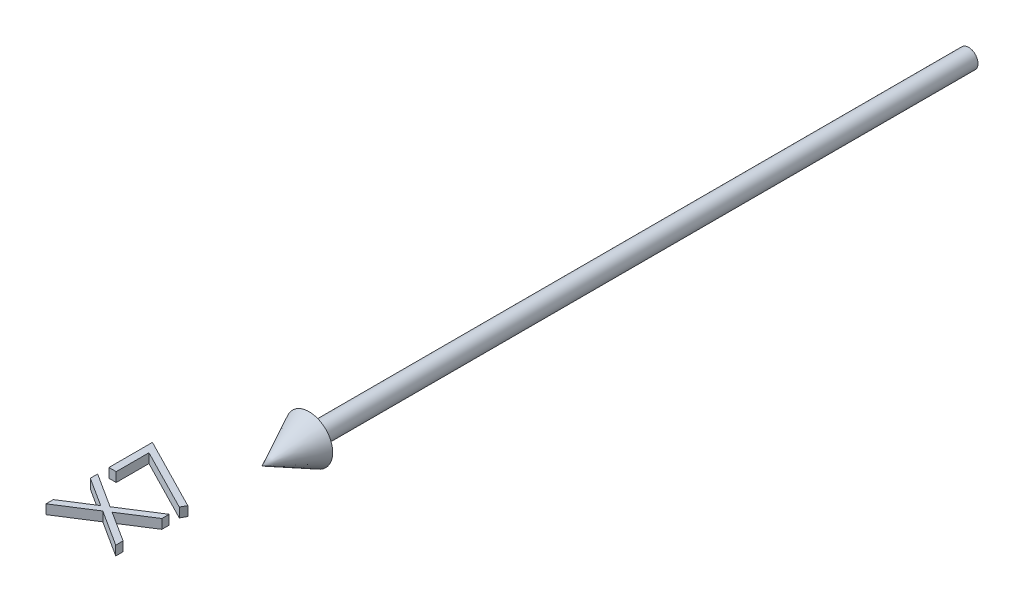
ISO-10303-21;
HEADER;
FILE_DESCRIPTION(('STEP AP214'),'2;1');
FILE_NAME('part.step','',(''),(''),'','','');
FILE_SCHEMA(('AUTOMOTIVE_DESIGN { 1 0 10303 214 1 1 1 1 }'));
ENDSEC;
DATA;
#1=APPLICATION_CONTEXT('core data for automotive mechanical design processes');
#2=APPLICATION_PROTOCOL_DEFINITION('international standard','automotive_design',2000,#1);
#3=PRODUCT_CONTEXT('',#1,'mechanical');
#4=PRODUCT('Part','Part','',(#3));
#5=PRODUCT_RELATED_PRODUCT_CATEGORY('part','',(#4));
#6=PRODUCT_DEFINITION_FORMATION('','',#4);
#7=PRODUCT_DEFINITION_CONTEXT('part definition',#1,'design');
#8=PRODUCT_DEFINITION('design','',#6,#7);
#9=PRODUCT_DEFINITION_SHAPE('','',#8);
#10=(LENGTH_UNIT() NAMED_UNIT(*) SI_UNIT(.MILLI.,.METRE.));
#11=(NAMED_UNIT(*) PLANE_ANGLE_UNIT() SI_UNIT($,.RADIAN.));
#12=(NAMED_UNIT(*) SI_UNIT($,.STERADIAN.) SOLID_ANGLE_UNIT());
#13=UNCERTAINTY_MEASURE_WITH_UNIT(LENGTH_MEASURE(1.E-05),#10,'distance_accuracy_value','');
#14=(GEOMETRIC_REPRESENTATION_CONTEXT(3) GLOBAL_UNCERTAINTY_ASSIGNED_CONTEXT((#13)) GLOBAL_UNIT_ASSIGNED_CONTEXT((#10,
#11,#12)) REPRESENTATION_CONTEXT('',''));
#15=CARTESIAN_POINT('',(0.,0.,0.));
#16=DIRECTION('',(0.,0.,1.));
#17=DIRECTION('',(1.,0.,0.));
#18=AXIS2_PLACEMENT_3D('',#15,#16,#17);
#19=CARTESIAN_POINT('',(-7.65024038461539,1.,176.159855769231));
#20=DIRECTION('',(0.539190475611023,0.,0.842183846324755));
#21=DIRECTION('',(0.842183846324755,0.,-0.539190475611023));
#22=AXIS2_PLACEMENT_3D('',#19,#20,#21);
#23=PLANE('',#22);
#24=DIRECTION('',(0.,-1.,0.));
#25=VECTOR('',#24,1.);
#26=CARTESIAN_POINT('',(-15.,1.,180.865384615385));
#27=LINE('',#26,#25);
#28=CARTESIAN_POINT('',(-15.,1.,180.865384615385));
#29=VERTEX_POINT('',#28);
#30=CARTESIAN_POINT('',(-15.,-1.,180.865384615385));
#31=VERTEX_POINT('',#30);
#32=EDGE_CURVE('E49',#29,#31,#27,.T.);
#33=ORIENTED_EDGE('',*,*,#32,.T.);
#34=DIRECTION('',(-0.842183846324755,0.,0.539190475611023));
#35=VECTOR('',#34,1.);
#36=CARTESIAN_POINT('',(-7.65024038461539,-1.,176.159855769231));
#37=LINE('',#36,#35);
#38=CARTESIAN_POINT('',(-7.65024038461539,-1.,176.159855769231));
#39=VERTEX_POINT('',#38);
#40=EDGE_CURVE('E134',#39,#31,#37,.T.);
#41=ORIENTED_EDGE('',*,*,#40,.F.);
#42=DIRECTION('',(0.,-1.,0.));
#43=VECTOR('',#42,1.);
#44=CARTESIAN_POINT('',(-7.65024038461539,1.,176.159855769231));
#45=LINE('',#44,#43);
#46=CARTESIAN_POINT('',(-7.65024038461539,1.,176.159855769231));
#47=VERTEX_POINT('',#46);
#48=EDGE_CURVE('E12',#47,#39,#45,.T.);
#49=ORIENTED_EDGE('',*,*,#48,.F.);
#50=DIRECTION('',(-0.842183846324755,0.,0.539190475611023));
#51=VECTOR('',#50,1.);
#52=CARTESIAN_POINT('',(-7.65024038461539,1.,176.159855769231));
#53=LINE('',#52,#51);
#54=EDGE_CURVE('E135',#47,#29,#53,.T.);
#55=ORIENTED_EDGE('',*,*,#54,.T.);
#56=EDGE_LOOP('',(#33,#41,#49,#55));
#57=FACE_BOUND('',#56,.T.);
#58=ADVANCED_FACE('F46',(#57),#23,.T.);
#59=CARTESIAN_POINT('',(0.,1.,181.057692307692));
#60=DIRECTION('',(-0.539185104098949,0.,0.842187285298113));
#61=DIRECTION('',(0.842187285298113,0.,0.539185104098949));
#62=AXIS2_PLACEMENT_3D('',#59,#60,#61);
#63=PLANE('',#62);
#64=ORIENTED_EDGE('',*,*,#48,.T.);
#65=DIRECTION('',(-0.842187285298113,0.,-0.539185104098949));
#66=VECTOR('',#65,1.);
#67=CARTESIAN_POINT('',(0.,-1.,181.057692307692));
#68=LINE('',#67,#66);
#69=CARTESIAN_POINT('',(0.,-1.,181.057692307692));
#70=VERTEX_POINT('',#69);
#71=EDGE_CURVE('E152',#70,#39,#68,.T.);
#72=ORIENTED_EDGE('',*,*,#71,.F.);
#73=DIRECTION('',(0.,-1.,0.));
#74=VECTOR('',#73,1.);
#75=CARTESIAN_POINT('',(0.,1.,181.057692307692));
#76=LINE('',#75,#74);
#77=CARTESIAN_POINT('',(0.,1.,181.057692307692));
#78=VERTEX_POINT('',#77);
#79=EDGE_CURVE('E54',#78,#70,#76,.T.);
#80=ORIENTED_EDGE('',*,*,#79,.F.);
#81=DIRECTION('',(-0.842187285298113,0.,-0.539185104098949));
#82=VECTOR('',#81,1.);
#83=CARTESIAN_POINT('',(0.,1.,181.057692307692));
#84=LINE('',#83,#82);
#85=EDGE_CURVE('E140',#78,#47,#84,.T.);
#86=ORIENTED_EDGE('',*,*,#85,.T.);
#87=EDGE_LOOP('',(#64,#72,#80,#86));
#88=FACE_BOUND('',#87,.T.);
#89=ADVANCED_FACE('F264',(#88),#63,.T.);
#90=CARTESIAN_POINT('',(0.,1.,179.504206730769));
#91=DIRECTION('',(1.,0.,0.));
#92=DIRECTION('',(0.,0.,-1.));
#93=AXIS2_PLACEMENT_3D('',#90,#91,#92);
#94=PLANE('',#93);
#95=ORIENTED_EDGE('',*,*,#79,.T.);
#96=DIRECTION('',(0.,0.,1.));
#97=VECTOR('',#96,1.);
#98=CARTESIAN_POINT('',(0.,-1.,179.504206730769));
#99=LINE('',#98,#97);
#100=CARTESIAN_POINT('',(0.,-1.,179.504206730769));
#101=VERTEX_POINT('',#100);
#102=EDGE_CURVE('E177',#101,#70,#99,.T.);
#103=ORIENTED_EDGE('',*,*,#102,.F.);
#104=DIRECTION('',(0.,-1.,0.));
#105=VECTOR('',#104,1.);
#106=CARTESIAN_POINT('',(0.,1.,179.504206730769));
#107=LINE('',#106,#105);
#108=CARTESIAN_POINT('',(0.,1.,179.504206730769));
#109=VERTEX_POINT('',#108);
#110=EDGE_CURVE('E211',#109,#101,#107,.T.);
#111=ORIENTED_EDGE('',*,*,#110,.F.);
#112=DIRECTION('',(0.,0.,1.));
#113=VECTOR('',#112,1.);
#114=CARTESIAN_POINT('',(0.,1.,179.504206730769));
#115=LINE('',#114,#113);
#116=EDGE_CURVE('E207',#109,#78,#115,.T.);
#117=ORIENTED_EDGE('',*,*,#116,.T.);
#118=EDGE_LOOP('',(#95,#103,#111,#117));
#119=FACE_BOUND('',#118,.T.);
#120=ADVANCED_FACE('F262',(#119),#94,.T.);
#121=CARTESIAN_POINT('',(-6.43629807692308,1.,175.384615384615));
#122=DIRECTION('',(0.539087169942496,0.,-0.842249976671648));
#123=DIRECTION('',(-0.842249976671648,0.,-0.539087169942496));
#124=AXIS2_PLACEMENT_3D('',#121,#122,#123);
#125=PLANE('',#124);
#126=ORIENTED_EDGE('',*,*,#110,.T.);
#127=DIRECTION('',(0.842249976671648,0.,0.539087169942496));
#128=VECTOR('',#127,1.);
#129=CARTESIAN_POINT('',(-6.43629807692308,-1.,175.384615384615));
#130=LINE('',#129,#128);
#131=CARTESIAN_POINT('',(-6.43629807692308,-1.,175.384615384615));
#132=VERTEX_POINT('',#131);
#133=EDGE_CURVE('E174',#132,#101,#130,.T.);
#134=ORIENTED_EDGE('',*,*,#133,.F.);
#135=DIRECTION('',(0.,-1.,0.));
#136=VECTOR('',#135,1.);
#137=CARTESIAN_POINT('',(-6.43629807692308,1.,175.384615384615));
#138=LINE('',#137,#136);
#139=CARTESIAN_POINT('',(-6.43629807692308,1.,175.384615384615));
#140=VERTEX_POINT('',#139);
#141=EDGE_CURVE('E213',#140,#132,#138,.T.);
#142=ORIENTED_EDGE('',*,*,#141,.F.);
#143=DIRECTION('',(0.842249976671648,0.,0.539087169942496));
#144=VECTOR('',#143,1.);
#145=CARTESIAN_POINT('',(-6.43629807692308,1.,175.384615384615));
#146=LINE('',#145,#144);
#147=EDGE_CURVE('E204',#140,#109,#146,.T.);
#148=ORIENTED_EDGE('',*,*,#147,.T.);
#149=EDGE_LOOP('',(#126,#134,#142,#148));
#150=FACE_BOUND('',#149,.T.);
#151=ADVANCED_FACE('F260',(#150),#125,.T.);
#152=CARTESIAN_POINT('',(0.,1.,171.265024038462));
#153=DIRECTION('',(0.539087169942498,0.,0.842249976671646));
#154=DIRECTION('',(0.842249976671646,0.,-0.539087169942498));
#155=AXIS2_PLACEMENT_3D('',#152,#153,#154);
#156=PLANE('',#155);
#157=ORIENTED_EDGE('',*,*,#141,.T.);
#158=DIRECTION('',(-0.842249976671646,0.,0.539087169942498));
#159=VECTOR('',#158,1.);
#160=CARTESIAN_POINT('',(0.,-1.,171.265024038462));
#161=LINE('',#160,#159);
#162=CARTESIAN_POINT('',(0.,-1.,171.265024038462));
#163=VERTEX_POINT('',#162);
#164=EDGE_CURVE('E171',#163,#132,#161,.T.);
#165=ORIENTED_EDGE('',*,*,#164,.F.);
#166=DIRECTION('',(0.,-1.,0.));
#167=VECTOR('',#166,1.);
#168=CARTESIAN_POINT('',(0.,1.,171.265024038462));
#169=LINE('',#168,#167);
#170=CARTESIAN_POINT('',(0.,1.,171.265024038462));
#171=VERTEX_POINT('',#170);
#172=EDGE_CURVE('E215',#171,#163,#169,.T.);
#173=ORIENTED_EDGE('',*,*,#172,.F.);
#174=DIRECTION('',(-0.842249976671646,0.,0.539087169942498));
#175=VECTOR('',#174,1.);
#176=CARTESIAN_POINT('',(0.,1.,171.265024038462));
#177=LINE('',#176,#175);
#178=EDGE_CURVE('E201',#171,#140,#177,.T.);
#179=ORIENTED_EDGE('',*,*,#178,.T.);
#180=EDGE_LOOP('',(#157,#165,#173,#179));
#181=FACE_BOUND('',#180,.T.);
#182=ADVANCED_FACE('F255',(#181),#156,.T.);
#183=CARTESIAN_POINT('',(0.,1.,169.711538461538));
#184=DIRECTION('',(1.,0.,0.));
#185=DIRECTION('',(0.,0.,-1.));
#186=AXIS2_PLACEMENT_3D('',#183,#184,#185);
#187=PLANE('',#186);
#188=ORIENTED_EDGE('',*,*,#172,.T.);
#189=DIRECTION('',(0.,0.,1.));
#190=VECTOR('',#189,1.);
#191=CARTESIAN_POINT('',(0.,-1.,169.711538461538));
#192=LINE('',#191,#190);
#193=CARTESIAN_POINT('',(0.,-1.,169.711538461538));
#194=VERTEX_POINT('',#193);
#195=EDGE_CURVE('E168',#194,#163,#192,.T.);
#196=ORIENTED_EDGE('',*,*,#195,.F.);
#197=DIRECTION('',(0.,-1.,0.));
#198=VECTOR('',#197,1.);
#199=CARTESIAN_POINT('',(0.,1.,169.711538461538));
#200=LINE('',#199,#198);
#201=CARTESIAN_POINT('',(0.,1.,169.711538461538));
#202=VERTEX_POINT('',#201);
#203=EDGE_CURVE('E217',#202,#194,#200,.T.);
#204=ORIENTED_EDGE('',*,*,#203,.F.);
#205=DIRECTION('',(0.,0.,1.));
#206=VECTOR('',#205,1.);
#207=CARTESIAN_POINT('',(0.,1.,169.711538461538));
#208=LINE('',#207,#206);
#209=EDGE_CURVE('E198',#202,#171,#208,.T.);
#210=ORIENTED_EDGE('',*,*,#209,.T.);
#211=EDGE_LOOP('',(#188,#196,#204,#210));
#212=FACE_BOUND('',#211,.T.);
#213=ADVANCED_FACE('F250',(#212),#187,.T.);
#214=CARTESIAN_POINT('',(-7.65024038461539,1.,174.606370192308));
#215=DIRECTION('',(-0.538950419912938,0.,-0.842337488703707));
#216=DIRECTION('',(-0.842337488703707,0.,0.538950419912938));
#217=AXIS2_PLACEMENT_3D('',#214,#215,#216);
#218=PLANE('',#217);
#219=ORIENTED_EDGE('',*,*,#203,.T.);
#220=DIRECTION('',(0.842337488703707,0.,-0.538950419912938));
#221=VECTOR('',#220,1.);
#222=CARTESIAN_POINT('',(-7.65024038461539,-1.,174.606370192308));
#223=LINE('',#222,#221);
#224=CARTESIAN_POINT('',(-7.65024038461539,-1.,174.606370192308));
#225=VERTEX_POINT('',#224);
#226=EDGE_CURVE('E165',#225,#194,#223,.T.);
#227=ORIENTED_EDGE('',*,*,#226,.F.);
#228=DIRECTION('',(0.,-1.,0.));
#229=VECTOR('',#228,1.);
#230=CARTESIAN_POINT('',(-7.65024038461539,1.,174.606370192308));
#231=LINE('',#230,#229);
#232=CARTESIAN_POINT('',(-7.65024038461539,1.,174.606370192308));
#233=VERTEX_POINT('',#232);
#234=EDGE_CURVE('E219',#233,#225,#231,.T.);
#235=ORIENTED_EDGE('',*,*,#234,.F.);
#236=DIRECTION('',(0.842337488703707,0.,-0.538950419912938));
#237=VECTOR('',#236,1.);
#238=CARTESIAN_POINT('',(-7.65024038461539,1.,174.606370192308));
#239=LINE('',#238,#237);
#240=EDGE_CURVE('E195',#233,#202,#239,.T.);
#241=ORIENTED_EDGE('',*,*,#240,.T.);
#242=EDGE_LOOP('',(#219,#227,#235,#241));
#243=FACE_BOUND('',#242,.T.);
#244=ADVANCED_FACE('F248',(#243),#218,.T.);
#245=CARTESIAN_POINT('',(-15.,1.,169.903846153846));
#246=DIRECTION('',(0.538946197134425,0.,-0.842340190537257));
#247=DIRECTION('',(-0.842340190537257,0.,-0.538946197134425));
#248=AXIS2_PLACEMENT_3D('',#245,#246,#247);
#249=PLANE('',#248);
#250=ORIENTED_EDGE('',*,*,#234,.T.);
#251=DIRECTION('',(0.842340190537257,0.,0.538946197134425));
#252=VECTOR('',#251,1.);
#253=CARTESIAN_POINT('',(-15.,-1.,169.903846153846));
#254=LINE('',#253,#252);
#255=CARTESIAN_POINT('',(-15.,-1.,169.903846153846));
#256=VERTEX_POINT('',#255);
#257=EDGE_CURVE('E162',#256,#225,#254,.T.);
#258=ORIENTED_EDGE('',*,*,#257,.F.);
#259=DIRECTION('',(0.,-1.,0.));
#260=VECTOR('',#259,1.);
#261=CARTESIAN_POINT('',(-15.,1.,169.903846153846));
#262=LINE('',#261,#260);
#263=CARTESIAN_POINT('',(-15.,1.,169.903846153846));
#264=VERTEX_POINT('',#263);
#265=EDGE_CURVE('E221',#264,#256,#262,.T.);
#266=ORIENTED_EDGE('',*,*,#265,.F.);
#267=DIRECTION('',(0.842340190537257,0.,0.538946197134425));
#268=VECTOR('',#267,1.);
#269=CARTESIAN_POINT('',(-15.,1.,169.903846153846));
#270=LINE('',#269,#268);
#271=EDGE_CURVE('E192',#264,#233,#270,.T.);
#272=ORIENTED_EDGE('',*,*,#271,.T.);
#273=EDGE_LOOP('',(#250,#258,#266,#272));
#274=FACE_BOUND('',#273,.T.);
#275=ADVANCED_FACE('F243',(#274),#249,.T.);
#276=CARTESIAN_POINT('',(-15.,1.,171.457331730769));
#277=DIRECTION('',(-1.,0.,0.));
#278=DIRECTION('',(0.,0.,1.));
#279=AXIS2_PLACEMENT_3D('',#276,#277,#278);
#280=PLANE('',#279);
#281=ORIENTED_EDGE('',*,*,#265,.T.);
#282=DIRECTION('',(0.,0.,-1.));
#283=VECTOR('',#282,1.);
#284=CARTESIAN_POINT('',(-15.,-1.,171.457331730769));
#285=LINE('',#284,#283);
#286=CARTESIAN_POINT('',(-15.,-1.,171.457331730769));
#287=VERTEX_POINT('',#286);
#288=EDGE_CURVE('E159',#287,#256,#285,.T.);
#289=ORIENTED_EDGE('',*,*,#288,.F.);
#290=DIRECTION('',(0.,-1.,0.));
#291=VECTOR('',#290,1.);
#292=CARTESIAN_POINT('',(-15.,1.,171.457331730769));
#293=LINE('',#292,#291);
#294=CARTESIAN_POINT('',(-15.,1.,171.457331730769));
#295=VERTEX_POINT('',#294);
#296=EDGE_CURVE('E223',#295,#287,#293,.T.);
#297=ORIENTED_EDGE('',*,*,#296,.F.);
#298=DIRECTION('',(0.,0.,-1.));
#299=VECTOR('',#298,1.);
#300=CARTESIAN_POINT('',(-15.,1.,171.457331730769));
#301=LINE('',#300,#299);
#302=EDGE_CURVE('E189',#295,#264,#301,.T.);
#303=ORIENTED_EDGE('',*,*,#302,.T.);
#304=EDGE_LOOP('',(#281,#289,#297,#303));
#305=FACE_BOUND('',#304,.T.);
#306=ADVANCED_FACE('F236',(#305),#280,.T.);
#307=CARTESIAN_POINT('',(-8.86418269230769,1.,175.384615384615));
#308=DIRECTION('',(-0.539088809128563,0.,0.842248927498485));
#309=DIRECTION('',(0.842248927498485,0.,0.539088809128563));
#310=AXIS2_PLACEMENT_3D('',#307,#308,#309);
#311=PLANE('',#310);
#312=ORIENTED_EDGE('',*,*,#296,.T.);
#313=DIRECTION('',(-0.842248927498485,0.,-0.539088809128563));
#314=VECTOR('',#313,1.);
#315=CARTESIAN_POINT('',(-8.86418269230769,-1.,175.384615384615));
#316=LINE('',#315,#314);
#317=CARTESIAN_POINT('',(-8.86418269230769,-1.,175.384615384615));
#318=VERTEX_POINT('',#317);
#319=EDGE_CURVE('E156',#318,#287,#316,.T.);
#320=ORIENTED_EDGE('',*,*,#319,.F.);
#321=DIRECTION('',(0.,-1.,0.));
#322=VECTOR('',#321,1.);
#323=CARTESIAN_POINT('',(-8.86418269230769,1.,175.384615384615));
#324=LINE('',#323,#322);
#325=CARTESIAN_POINT('',(-8.86418269230769,1.,175.384615384615));
#326=VERTEX_POINT('',#325);
#327=EDGE_CURVE('E225',#326,#318,#324,.T.);
#328=ORIENTED_EDGE('',*,*,#327,.F.);
#329=DIRECTION('',(-0.842248927498485,0.,-0.539088809128563));
#330=VECTOR('',#329,1.);
#331=CARTESIAN_POINT('',(-8.86418269230769,1.,175.384615384615));
#332=LINE('',#331,#330);
#333=EDGE_CURVE('E186',#326,#295,#332,.T.);
#334=ORIENTED_EDGE('',*,*,#333,.T.);
#335=EDGE_LOOP('',(#312,#320,#328,#334));
#336=FACE_BOUND('',#335,.T.);
#337=ADVANCED_FACE('F233',(#336),#311,.T.);
#338=CARTESIAN_POINT('',(-15.,1.,179.311899038462));
#339=DIRECTION('',(-0.53908880912856,0.,-0.842248927498487));
#340=DIRECTION('',(-0.842248927498487,0.,0.53908880912856));
#341=AXIS2_PLACEMENT_3D('',#338,#339,#340);
#342=PLANE('',#341);
#343=ORIENTED_EDGE('',*,*,#327,.T.);
#344=DIRECTION('',(0.842248927498486,0.,-0.53908880912856));
#345=VECTOR('',#344,1.);
#346=CARTESIAN_POINT('',(-15.,-1.,179.311899038462));
#347=LINE('',#346,#345);
#348=CARTESIAN_POINT('',(-15.,-1.,179.311899038462));
#349=VERTEX_POINT('',#348);
#350=EDGE_CURVE('E147',#349,#318,#347,.T.);
#351=ORIENTED_EDGE('',*,*,#350,.F.);
#352=DIRECTION('',(0.,-1.,0.));
#353=VECTOR('',#352,1.);
#354=CARTESIAN_POINT('',(-15.,1.,179.311899038462));
#355=LINE('',#354,#353);
#356=CARTESIAN_POINT('',(-15.,1.,179.311899038462));
#357=VERTEX_POINT('',#356);
#358=EDGE_CURVE('E139',#357,#349,#355,.T.);
#359=ORIENTED_EDGE('',*,*,#358,.F.);
#360=DIRECTION('',(0.842248927498486,0.,-0.53908880912856));
#361=VECTOR('',#360,1.);
#362=CARTESIAN_POINT('',(-15.,1.,179.311899038462));
#363=LINE('',#362,#361);
#364=EDGE_CURVE('E183',#357,#326,#363,.T.);
#365=ORIENTED_EDGE('',*,*,#364,.T.);
#366=EDGE_LOOP('',(#343,#351,#359,#365));
#367=FACE_BOUND('',#366,.T.);
#368=ADVANCED_FACE('F227',(#367),#342,.T.);
#369=CARTESIAN_POINT('',(-15.,1.,180.865384615385));
#370=DIRECTION('',(-1.,0.,0.));
#371=DIRECTION('',(0.,0.,1.));
#372=AXIS2_PLACEMENT_3D('',#369,#370,#371);
#373=PLANE('',#372);
#374=ORIENTED_EDGE('',*,*,#358,.T.);
#375=DIRECTION('',(0.,0.,-1.));
#376=VECTOR('',#375,1.);
#377=CARTESIAN_POINT('',(-15.,-1.,180.865384615385));
#378=LINE('',#377,#376);
#379=EDGE_CURVE('E142',#31,#349,#378,.T.);
#380=ORIENTED_EDGE('',*,*,#379,.F.);
#381=ORIENTED_EDGE('',*,*,#32,.F.);
#382=DIRECTION('',(0.,0.,-1.));
#383=VECTOR('',#382,1.);
#384=CARTESIAN_POINT('',(-15.,1.,180.865384615385));
#385=LINE('',#384,#383);
#386=EDGE_CURVE('E181',#29,#357,#385,.T.);
#387=ORIENTED_EDGE('',*,*,#386,.T.);
#388=EDGE_LOOP('',(#374,#380,#381,#387));
#389=FACE_BOUND('',#388,.T.);
#390=ADVANCED_FACE('F143',(#389),#373,.T.);
#391=CARTESIAN_POINT('',(0.,1.,0.));
#392=DIRECTION('',(0.,-1.,0.));
#393=DIRECTION('',(0.,0.,-1.));
#394=AXIS2_PLACEMENT_3D('',#391,#392,#393);
#395=PLANE('',#394);
#396=ORIENTED_EDGE('',*,*,#54,.F.);
#397=ORIENTED_EDGE('',*,*,#85,.F.);
#398=ORIENTED_EDGE('',*,*,#116,.F.);
#399=ORIENTED_EDGE('',*,*,#147,.F.);
#400=ORIENTED_EDGE('',*,*,#178,.F.);
#401=ORIENTED_EDGE('',*,*,#209,.F.);
#402=ORIENTED_EDGE('',*,*,#240,.F.);
#403=ORIENTED_EDGE('',*,*,#271,.F.);
#404=ORIENTED_EDGE('',*,*,#302,.F.);
#405=ORIENTED_EDGE('',*,*,#333,.F.);
#406=ORIENTED_EDGE('',*,*,#364,.F.);
#407=ORIENTED_EDGE('',*,*,#386,.F.);
#408=EDGE_LOOP('',(#396,#397,#398,#399,#400,#401,#402,#403,#404,#405,#406,#407));
#409=FACE_BOUND('',#408,.T.);
#410=ADVANCED_FACE('F239',(#409),#395,.F.);
#411=CARTESIAN_POINT('',(0.,-1.,0.));
#412=DIRECTION('',(0.,-1.,0.));
#413=DIRECTION('',(0.,0.,-1.));
#414=AXIS2_PLACEMENT_3D('',#411,#412,#413);
#415=PLANE('',#414);
#416=ORIENTED_EDGE('',*,*,#40,.T.);
#417=ORIENTED_EDGE('',*,*,#379,.T.);
#418=ORIENTED_EDGE('',*,*,#350,.T.);
#419=ORIENTED_EDGE('',*,*,#319,.T.);
#420=ORIENTED_EDGE('',*,*,#288,.T.);
#421=ORIENTED_EDGE('',*,*,#257,.T.);
#422=ORIENTED_EDGE('',*,*,#226,.T.);
#423=ORIENTED_EDGE('',*,*,#195,.T.);
#424=ORIENTED_EDGE('',*,*,#164,.T.);
#425=ORIENTED_EDGE('',*,*,#133,.T.);
#426=ORIENTED_EDGE('',*,*,#102,.T.);
#427=ORIENTED_EDGE('',*,*,#71,.T.);
#428=EDGE_LOOP('',(#416,#417,#418,#419,#420,#421,#422,#423,#424,#425,#426,#427));
#429=FACE_BOUND('',#428,.T.);
#430=ADVANCED_FACE('F150',(#429),#415,.T.);
#431=CLOSED_SHELL('',(#58,#89,#120,#151,#182,#213,#244,#275,#306,#337,#368,#390,#410,#430));
#432=MANIFOLD_SOLID_BREP('B2',#431);
#433=CARTESIAN_POINT('',(-13.4615384615385,1.,167.5));
#434=DIRECTION('',(0.,0.,1.));
#435=DIRECTION('',(1.,0.,0.));
#436=AXIS2_PLACEMENT_3D('',#433,#434,#435);
#437=PLANE('',#436);
#438=DIRECTION('',(0.,-1.,0.));
#439=VECTOR('',#438,1.);
#440=CARTESIAN_POINT('',(-15.,1.,167.5));
#441=LINE('',#440,#439);
#442=CARTESIAN_POINT('',(-15.,1.,167.5));
#443=VERTEX_POINT('',#442);
#444=CARTESIAN_POINT('',(-15.,-1.,167.5));
#445=VERTEX_POINT('',#444);
#446=EDGE_CURVE('E432',#443,#445,#441,.T.);
#447=ORIENTED_EDGE('',*,*,#446,.T.);
#448=DIRECTION('',(-1.,0.,0.));
#449=VECTOR('',#448,1.);
#450=CARTESIAN_POINT('',(-13.4615384615385,-1.,167.5));
#451=LINE('',#450,#449);
#452=CARTESIAN_POINT('',(-13.4615384615385,-1.,167.5));
#453=VERTEX_POINT('',#452);
#454=EDGE_CURVE('E481',#453,#445,#451,.T.);
#455=ORIENTED_EDGE('',*,*,#454,.F.);
#456=DIRECTION('',(0.,-1.,0.));
#457=VECTOR('',#456,1.);
#458=CARTESIAN_POINT('',(-13.4615384615385,1.,167.5));
#459=LINE('',#458,#457);
#460=CARTESIAN_POINT('',(-13.4615384615385,1.,167.5));
#461=VERTEX_POINT('',#460);
#462=EDGE_CURVE('E44',#461,#453,#459,.T.);
#463=ORIENTED_EDGE('',*,*,#462,.F.);
#464=DIRECTION('',(-1.,0.,0.));
#465=VECTOR('',#464,1.);
#466=CARTESIAN_POINT('',(-13.4615384615385,1.,167.5));
#467=LINE('',#466,#465);
#468=EDGE_CURVE('E482',#461,#443,#467,.T.);
#469=ORIENTED_EDGE('',*,*,#468,.T.);
#470=EDGE_LOOP('',(#447,#455,#463,#469));
#471=FACE_BOUND('',#470,.T.);
#472=ADVANCED_FACE('F429',(#471),#437,.T.);
#473=CARTESIAN_POINT('',(-13.4615384615385,1.,160.546875));
#474=DIRECTION('',(1.,0.,0.));
#475=DIRECTION('',(0.,0.,-1.));
#476=AXIS2_PLACEMENT_3D('',#473,#474,#475);
#477=PLANE('',#476);
#478=ORIENTED_EDGE('',*,*,#462,.T.);
#479=DIRECTION('',(0.,0.,1.));
#480=VECTOR('',#479,1.);
#481=CARTESIAN_POINT('',(-13.4615384615385,-1.,160.546875));
#482=LINE('',#481,#480);
#483=CARTESIAN_POINT('',(-13.4615384615385,-1.,160.546875));
#484=VERTEX_POINT('',#483);
#485=EDGE_CURVE('E499',#484,#453,#482,.T.);
#486=ORIENTED_EDGE('',*,*,#485,.F.);
#487=DIRECTION('',(0.,-1.,0.));
#488=VECTOR('',#487,1.);
#489=CARTESIAN_POINT('',(-13.4615384615385,1.,160.546875));
#490=LINE('',#489,#488);
#491=CARTESIAN_POINT('',(-13.4615384615385,1.,160.546875));
#492=VERTEX_POINT('',#491);
#493=EDGE_CURVE('E437',#492,#484,#490,.T.);
#494=ORIENTED_EDGE('',*,*,#493,.F.);
#495=DIRECTION('',(0.,0.,1.));
#496=VECTOR('',#495,1.);
#497=CARTESIAN_POINT('',(-13.4615384615385,1.,160.546875));
#498=LINE('',#497,#496);
#499=EDGE_CURVE('E487',#492,#461,#498,.T.);
#500=ORIENTED_EDGE('',*,*,#499,.T.);
#501=EDGE_LOOP('',(#478,#486,#494,#500));
#502=FACE_BOUND('',#501,.T.);
#503=ADVANCED_FACE('F539',(#502),#477,.T.);
#504=CARTESIAN_POINT('',(-0.255408653846154,1.,167.316706730769));
#505=DIRECTION('',(-0.456180989989926,0.,0.889887017756643));
#506=DIRECTION('',(0.889887017756643,0.,0.456180989989926));
#507=AXIS2_PLACEMENT_3D('',#504,#505,#506);
#508=PLANE('',#507);
#509=ORIENTED_EDGE('',*,*,#493,.T.);
#510=DIRECTION('',(-0.889887017756643,0.,-0.456180989989926));
#511=VECTOR('',#510,1.);
#512=CARTESIAN_POINT('',(-0.255408653846154,-1.,167.316706730769));
#513=LINE('',#512,#511);
#514=CARTESIAN_POINT('',(-0.255408653846154,-1.,167.316706730769));
#515=VERTEX_POINT('',#514);
#516=EDGE_CURVE('E506',#515,#484,#513,.T.);
#517=ORIENTED_EDGE('',*,*,#516,.F.);
#518=DIRECTION('',(0.,-1.,0.));
#519=VECTOR('',#518,1.);
#520=CARTESIAN_POINT('',(-0.255408653846154,1.,167.316706730769));
#521=LINE('',#520,#519);
#522=CARTESIAN_POINT('',(-0.255408653846154,1.,167.316706730769));
#523=VERTEX_POINT('',#522);
#524=EDGE_CURVE('E522',#523,#515,#521,.T.);
#525=ORIENTED_EDGE('',*,*,#524,.F.);
#526=DIRECTION('',(-0.889887017756643,0.,-0.456180989989926));
#527=VECTOR('',#526,1.);
#528=CARTESIAN_POINT('',(-0.255408653846154,1.,167.316706730769));
#529=LINE('',#528,#527);
#530=EDGE_CURVE('E518',#523,#492,#529,.T.);
#531=ORIENTED_EDGE('',*,*,#530,.T.);
#532=EDGE_LOOP('',(#509,#517,#525,#531));
#533=FACE_BOUND('',#532,.T.);
#534=ADVANCED_FACE('F535',(#533),#508,.T.);
#535=CARTESIAN_POINT('',(0.384615384615385,1.,166.153846153846));
#536=DIRECTION('',(0.876072484374681,0.,0.482179429384513));
#537=DIRECTION('',(0.482179429384513,0.,-0.876072484374681));
#538=AXIS2_PLACEMENT_3D('',#535,#536,#537);
#539=PLANE('',#538);
#540=ORIENTED_EDGE('',*,*,#524,.T.);
#541=DIRECTION('',(-0.482179429384513,0.,0.876072484374681));
#542=VECTOR('',#541,1.);
#543=CARTESIAN_POINT('',(0.384615384615385,-1.,166.153846153846));
#544=LINE('',#543,#542);
#545=CARTESIAN_POINT('',(0.384615384615385,-1.,166.153846153846));
#546=VERTEX_POINT('',#545);
#547=EDGE_CURVE('E503',#546,#515,#544,.T.);
#548=ORIENTED_EDGE('',*,*,#547,.F.);
#549=DIRECTION('',(0.,-1.,0.));
#550=VECTOR('',#549,1.);
#551=CARTESIAN_POINT('',(0.384615384615385,1.,166.153846153846));
#552=LINE('',#551,#550);
#553=CARTESIAN_POINT('',(0.384615384615385,1.,166.153846153846));
#554=VERTEX_POINT('',#553);
#555=EDGE_CURVE('E524',#554,#546,#552,.T.);
#556=ORIENTED_EDGE('',*,*,#555,.F.);
#557=DIRECTION('',(-0.482179429384513,0.,0.876072484374681));
#558=VECTOR('',#557,1.);
#559=CARTESIAN_POINT('',(0.384615384615385,1.,166.153846153846));
#560=LINE('',#559,#558);
#561=EDGE_CURVE('E515',#554,#523,#560,.T.);
#562=ORIENTED_EDGE('',*,*,#561,.T.);
#563=EDGE_LOOP('',(#540,#548,#556,#562));
#564=FACE_BOUND('',#563,.T.);
#565=ADVANCED_FACE('F532',(#564),#539,.T.);
#566=CARTESIAN_POINT('',(-15.,1.,158.269230769231));
#567=DIRECTION('',(0.4560907909104,0.,-0.889933250556875));
#568=DIRECTION('',(-0.889933250556875,0.,-0.4560907909104));
#569=AXIS2_PLACEMENT_3D('',#566,#567,#568);
#570=PLANE('',#569);
#571=ORIENTED_EDGE('',*,*,#555,.T.);
#572=DIRECTION('',(0.889933250556875,0.,0.4560907909104));
#573=VECTOR('',#572,1.);
#574=CARTESIAN_POINT('',(-15.,-1.,158.269230769231));
#575=LINE('',#574,#573);
#576=CARTESIAN_POINT('',(-15.,-1.,158.269230769231));
#577=VERTEX_POINT('',#576);
#578=EDGE_CURVE('E494',#577,#546,#575,.T.);
#579=ORIENTED_EDGE('',*,*,#578,.F.);
#580=DIRECTION('',(0.,-1.,0.));
#581=VECTOR('',#580,1.);
#582=CARTESIAN_POINT('',(-15.,1.,158.269230769231));
#583=LINE('',#582,#581);
#584=CARTESIAN_POINT('',(-15.,1.,158.269230769231));
#585=VERTEX_POINT('',#584);
#586=EDGE_CURVE('E486',#585,#577,#583,.T.);
#587=ORIENTED_EDGE('',*,*,#586,.F.);
#588=DIRECTION('',(0.889933250556875,0.,0.4560907909104));
#589=VECTOR('',#588,1.);
#590=CARTESIAN_POINT('',(-15.,1.,158.269230769231));
#591=LINE('',#590,#589);
#592=EDGE_CURVE('E512',#585,#554,#591,.T.);
#593=ORIENTED_EDGE('',*,*,#592,.T.);
#594=EDGE_LOOP('',(#571,#579,#587,#593));
#595=FACE_BOUND('',#594,.T.);
#596=ADVANCED_FACE('F526',(#595),#570,.T.);
#597=CARTESIAN_POINT('',(-15.,1.,167.5));
#598=DIRECTION('',(-1.,0.,0.));
#599=DIRECTION('',(0.,0.,1.));
#600=AXIS2_PLACEMENT_3D('',#597,#598,#599);
#601=PLANE('',#600);
#602=ORIENTED_EDGE('',*,*,#586,.T.);
#603=DIRECTION('',(0.,0.,-1.));
#604=VECTOR('',#603,1.);
#605=CARTESIAN_POINT('',(-15.,-1.,167.5));
#606=LINE('',#605,#604);
#607=EDGE_CURVE('E489',#445,#577,#606,.T.);
#608=ORIENTED_EDGE('',*,*,#607,.F.);
#609=ORIENTED_EDGE('',*,*,#446,.F.);
#610=DIRECTION('',(0.,0.,-1.));
#611=VECTOR('',#610,1.);
#612=CARTESIAN_POINT('',(-15.,1.,167.5));
#613=LINE('',#612,#611);
#614=EDGE_CURVE('E510',#443,#585,#613,.T.);
#615=ORIENTED_EDGE('',*,*,#614,.T.);
#616=EDGE_LOOP('',(#602,#608,#609,#615));
#617=FACE_BOUND('',#616,.T.);
#618=ADVANCED_FACE('F490',(#617),#601,.T.);
#619=CARTESIAN_POINT('',(0.,1.,0.));
#620=DIRECTION('',(0.,-1.,0.));
#621=DIRECTION('',(0.,0.,-1.));
#622=AXIS2_PLACEMENT_3D('',#619,#620,#621);
#623=PLANE('',#622);
#624=ORIENTED_EDGE('',*,*,#468,.F.);
#625=ORIENTED_EDGE('',*,*,#499,.F.);
#626=ORIENTED_EDGE('',*,*,#530,.F.);
#627=ORIENTED_EDGE('',*,*,#561,.F.);
#628=ORIENTED_EDGE('',*,*,#592,.F.);
#629=ORIENTED_EDGE('',*,*,#614,.F.);
#630=EDGE_LOOP('',(#624,#625,#626,#627,#628,#629));
#631=FACE_BOUND('',#630,.T.);
#632=ADVANCED_FACE('F538',(#631),#623,.F.);
#633=CARTESIAN_POINT('',(0.,-1.,0.));
#634=DIRECTION('',(0.,-1.,0.));
#635=DIRECTION('',(0.,0.,-1.));
#636=AXIS2_PLACEMENT_3D('',#633,#634,#635);
#637=PLANE('',#636);
#638=ORIENTED_EDGE('',*,*,#454,.T.);
#639=ORIENTED_EDGE('',*,*,#607,.T.);
#640=ORIENTED_EDGE('',*,*,#578,.T.);
#641=ORIENTED_EDGE('',*,*,#547,.T.);
#642=ORIENTED_EDGE('',*,*,#516,.T.);
#643=ORIENTED_EDGE('',*,*,#485,.T.);
#644=EDGE_LOOP('',(#638,#639,#640,#641,#642,#643));
#645=FACE_BOUND('',#644,.T.);
#646=ADVANCED_FACE('F497',(#645),#637,.T.);
#647=CLOSED_SHELL('',(#472,#503,#534,#565,#596,#618,#632,#646));
#648=MANIFOLD_SOLID_BREP('B6',#647);
#649=CARTESIAN_POINT('',(2.,0.,0.));
#650=DIRECTION('',(0.,0.,1.));
#651=DIRECTION('',(1.,0.,0.));
#652=AXIS2_PLACEMENT_3D('',#649,#650,#651);
#653=PLANE('',#652);
#654=CARTESIAN_POINT('',(0.,0.,0.));
#655=DIRECTION('',(0.,0.,-1.));
#656=DIRECTION('',(-1.,0.,0.));
#657=AXIS2_PLACEMENT_3D('',#654,#655,#656);
#658=CIRCLE('',#657,2.);
#659=CARTESIAN_POINT('',(-2.,0.,0.));
#660=VERTEX_POINT('',#659);
#661=EDGE_CURVE('E427',#660,#660,#658,.T.);
#662=ORIENTED_EDGE('',*,*,#661,.T.);
#663=EDGE_LOOP('',(#662));
#664=FACE_BOUND('',#663,.T.);
#665=ADVANCED_FACE('F635',(#664),#653,.F.);
#666=CARTESIAN_POINT('',(0.,0.,-41.9499520246458));
#667=DIRECTION('',(0.,0.,-1.));
#668=DIRECTION('',(-1.,0.,0.));
#669=AXIS2_PLACEMENT_3D('',#666,#667,#668);
#670=CYLINDRICAL_SURFACE('',#669,2.);
#671=ORIENTED_EDGE('',*,*,#661,.F.);
#672=EDGE_LOOP('',(#671));
#673=FACE_BOUND('',#672,.T.);
#674=CARTESIAN_POINT('',(0.,0.,140.));
#675=DIRECTION('',(0.,0.,-1.));
#676=DIRECTION('',(-1.,0.,0.));
#677=AXIS2_PLACEMENT_3D('',#674,#675,#676);
#678=CIRCLE('',#677,2.);
#679=CARTESIAN_POINT('',(-2.,0.,140.));
#680=VERTEX_POINT('',#679);
#681=EDGE_CURVE('E641',#680,#680,#678,.T.);
#682=ORIENTED_EDGE('',*,*,#681,.T.);
#683=EDGE_LOOP('',(#682));
#684=FACE_BOUND('',#683,.T.);
#685=ADVANCED_FACE('F652',(#673,#684),#670,.T.);
#686=CARTESIAN_POINT('',(5.00000000000002,0.,140.));
#687=DIRECTION('',(0.,0.,1.));
#688=DIRECTION('',(1.,0.,0.));
#689=AXIS2_PLACEMENT_3D('',#686,#687,#688);
#690=PLANE('',#689);
#691=ORIENTED_EDGE('',*,*,#681,.F.);
#692=EDGE_LOOP('',(#691));
#693=FACE_BOUND('',#692,.T.);
#694=CARTESIAN_POINT('',(0.,0.,140.));
#695=DIRECTION('',(0.,0.,-1.));
#696=DIRECTION('',(-1.,0.,0.));
#697=AXIS2_PLACEMENT_3D('',#694,#695,#696);
#698=CIRCLE('',#697,5.00000000000002);
#699=CARTESIAN_POINT('',(-5.00000000000002,0.,140.));
#700=VERTEX_POINT('',#699);
#701=EDGE_CURVE('E666',#700,#700,#698,.T.);
#702=ORIENTED_EDGE('',*,*,#701,.T.);
#703=EDGE_LOOP('',(#702));
#704=FACE_BOUND('',#703,.T.);
#705=ADVANCED_FACE('F646',(#693,#704),#690,.F.);
#706=CARTESIAN_POINT('',(0.,0.,150.));
#707=DIRECTION('',(0.,0.,-1.));
#708=DIRECTION('',(-1.,0.,0.));
#709=AXIS2_PLACEMENT_3D('',#706,#707,#708);
#710=CONICAL_SURFACE('',#709,0.,0.463647609000806);
#711=ORIENTED_EDGE('',*,*,#701,.F.);
#712=EDGE_LOOP('',(#711));
#713=FACE_BOUND('',#712,.T.);
#714=CARTESIAN_POINT('',(0.,0.,150.));
#715=VERTEX_POINT('',#714);
#716=VERTEX_LOOP('',#715);
#717=FACE_BOUND('',#716,.T.);
#718=ADVANCED_FACE('F644',(#713,#717),#710,.T.);
#719=CLOSED_SHELL('',(#665,#685,#705,#718));
#720=MANIFOLD_SOLID_BREP('B38',#719);
#721=ADVANCED_BREP_SHAPE_REPRESENTATION('',(#18,#432,#648,#720),#14);
#722=SHAPE_DEFINITION_REPRESENTATION(#9,#721);
ENDSEC;
END-ISO-10303-21;
